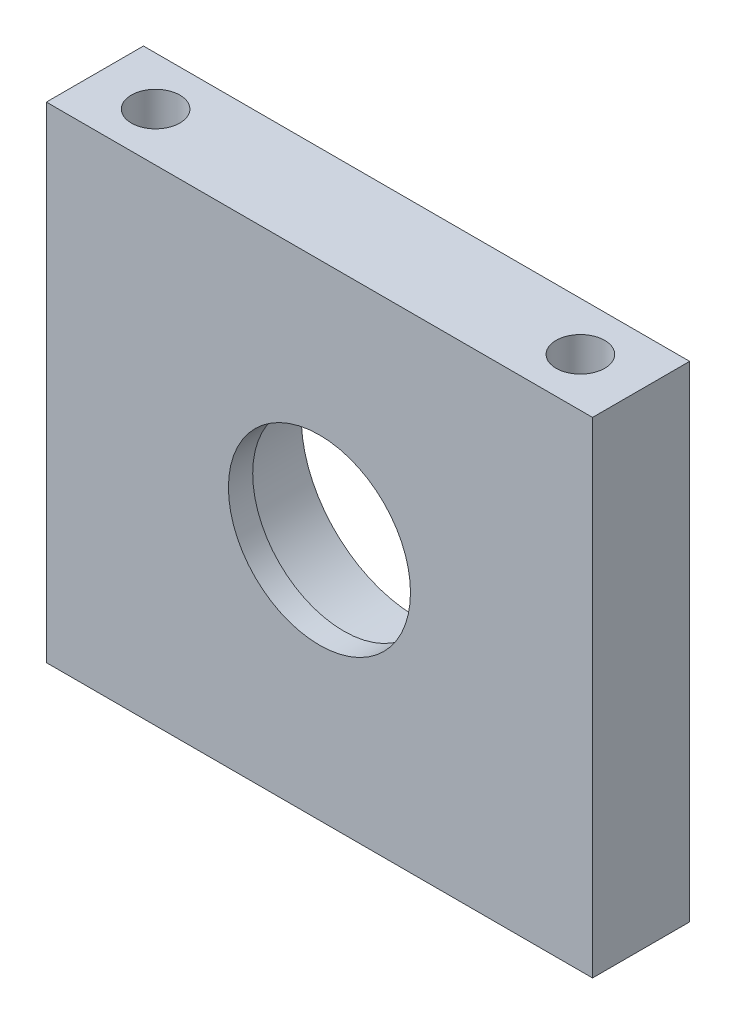
ISO-10303-21;
HEADER;
FILE_DESCRIPTION(('STEP AP214'),'2;1');
FILE_NAME('part.step','',(''),(''),'','','');
FILE_SCHEMA(('AUTOMOTIVE_DESIGN { 1 0 10303 214 1 1 1 1 }'));
ENDSEC;
DATA;
#1=APPLICATION_CONTEXT('core data for automotive mechanical design processes');
#2=APPLICATION_PROTOCOL_DEFINITION('international standard','automotive_design',2000,#1);
#3=PRODUCT_CONTEXT('',#1,'mechanical');
#4=PRODUCT('Part','Part','',(#3));
#5=PRODUCT_RELATED_PRODUCT_CATEGORY('part','',(#4));
#6=PRODUCT_DEFINITION_FORMATION('','',#4);
#7=PRODUCT_DEFINITION_CONTEXT('part definition',#1,'design');
#8=PRODUCT_DEFINITION('design','',#6,#7);
#9=PRODUCT_DEFINITION_SHAPE('','',#8);
#10=(LENGTH_UNIT() NAMED_UNIT(*) SI_UNIT(.MILLI.,.METRE.));
#11=(NAMED_UNIT(*) PLANE_ANGLE_UNIT() SI_UNIT($,.RADIAN.));
#12=(NAMED_UNIT(*) SI_UNIT($,.STERADIAN.) SOLID_ANGLE_UNIT());
#13=UNCERTAINTY_MEASURE_WITH_UNIT(LENGTH_MEASURE(1.E-05),#10,'distance_accuracy_value','');
#14=(GEOMETRIC_REPRESENTATION_CONTEXT(3) GLOBAL_UNCERTAINTY_ASSIGNED_CONTEXT((#13)) GLOBAL_UNIT_ASSIGNED_CONTEXT((#10,
#11,#12)) REPRESENTATION_CONTEXT('',''));
#15=CARTESIAN_POINT('',(0.,0.,0.));
#16=DIRECTION('',(0.,0.,1.));
#17=DIRECTION('',(1.,0.,0.));
#18=AXIS2_PLACEMENT_3D('',#15,#16,#17);
#19=CARTESIAN_POINT('',(0.,0.,0.));
#20=DIRECTION('',(0.,0.,-1.));
#21=DIRECTION('',(1.,0.,0.));
#22=AXIS2_PLACEMENT_3D('',#19,#20,#21);
#23=CYLINDRICAL_SURFACE('',#22,7.5);
#24=CARTESIAN_POINT('',(0.,0.,0.));
#25=DIRECTION('',(0.,0.,1.));
#26=DIRECTION('',(1.,0.,0.));
#27=AXIS2_PLACEMENT_3D('',#24,#25,#26);
#28=CIRCLE('',#27,7.5);
#29=CARTESIAN_POINT('',(7.5,0.,0.));
#30=VERTEX_POINT('',#29);
#31=EDGE_CURVE('E105',#30,#30,#28,.T.);
#32=ORIENTED_EDGE('',*,*,#31,.T.);
#33=EDGE_LOOP('',(#32));
#34=FACE_BOUND('',#33,.T.);
#35=CARTESIAN_POINT('',(0.,0.,-2.));
#36=DIRECTION('',(0.,0.,1.));
#37=DIRECTION('',(1.,0.,0.));
#38=AXIS2_PLACEMENT_3D('',#35,#36,#37);
#39=CIRCLE('',#38,7.5);
#40=CARTESIAN_POINT('',(7.5,0.,-2.));
#41=VERTEX_POINT('',#40);
#42=EDGE_CURVE('E39',#41,#41,#39,.F.);
#43=ORIENTED_EDGE('',*,*,#42,.T.);
#44=EDGE_LOOP('',(#43));
#45=FACE_BOUND('',#44,.T.);
#46=ADVANCED_FACE('F35',(#34,#45),#23,.F.);
#47=CARTESIAN_POINT('',(22.5,-20.,-8.));
#48=DIRECTION('',(-1.,0.,0.));
#49=DIRECTION('',(0.,0.,-1.));
#50=AXIS2_PLACEMENT_3D('',#47,#48,#49);
#51=PLANE('',#50);
#52=DIRECTION('',(0.,1.,0.));
#53=VECTOR('',#52,1.);
#54=CARTESIAN_POINT('',(22.5,-20.,0.));
#55=LINE('',#54,#53);
#56=CARTESIAN_POINT('',(22.5,-20.,0.));
#57=VERTEX_POINT('',#56);
#58=CARTESIAN_POINT('',(22.5,20.,0.));
#59=VERTEX_POINT('',#58);
#60=EDGE_CURVE('E102',#57,#59,#55,.T.);
#61=ORIENTED_EDGE('',*,*,#60,.F.);
#62=DIRECTION('',(0.,0.,1.));
#63=VECTOR('',#62,1.);
#64=CARTESIAN_POINT('',(22.5,-20.,-8.));
#65=LINE('',#64,#63);
#66=CARTESIAN_POINT('',(22.5,-20.,-8.));
#67=VERTEX_POINT('',#66);
#68=EDGE_CURVE('E101',#67,#57,#65,.T.);
#69=ORIENTED_EDGE('',*,*,#68,.F.);
#70=DIRECTION('',(0.,1.,0.));
#71=VECTOR('',#70,1.);
#72=CARTESIAN_POINT('',(22.5,-20.,-8.));
#73=LINE('',#72,#71);
#74=CARTESIAN_POINT('',(22.5,20.,-8.));
#75=VERTEX_POINT('',#74);
#76=EDGE_CURVE('E95',#67,#75,#73,.T.);
#77=ORIENTED_EDGE('',*,*,#76,.T.);
#78=DIRECTION('',(0.,0.,1.));
#79=VECTOR('',#78,1.);
#80=CARTESIAN_POINT('',(22.5,20.,-8.));
#81=LINE('',#80,#79);
#82=EDGE_CURVE('E11',#75,#59,#81,.T.);
#83=ORIENTED_EDGE('',*,*,#82,.T.);
#84=EDGE_LOOP('',(#61,#69,#77,#83));
#85=FACE_BOUND('',#84,.T.);
#86=ADVANCED_FACE('F37',(#85),#51,.F.);
#87=CARTESIAN_POINT('',(-22.5,20.,-8.));
#88=DIRECTION('',(0.,-1.,0.));
#89=DIRECTION('',(0.,0.,1.));
#90=AXIS2_PLACEMENT_3D('',#87,#88,#89);
#91=PLANE('',#90);
#92=CARTESIAN_POINT('',(-17.5,20.,-4.));
#93=DIRECTION('',(0.,-1.,0.));
#94=DIRECTION('',(0.,0.,-1.));
#95=AXIS2_PLACEMENT_3D('',#92,#93,#94);
#96=CIRCLE('',#95,2.);
#97=CARTESIAN_POINT('',(-17.5,20.,-6.));
#98=VERTEX_POINT('',#97);
#99=EDGE_CURVE('E162',#98,#98,#96,.T.);
#100=ORIENTED_EDGE('',*,*,#99,.T.);
#101=EDGE_LOOP('',(#100));
#102=FACE_BOUND('',#101,.T.);
#103=CARTESIAN_POINT('',(17.5,20.,-4.));
#104=DIRECTION('',(0.,-1.,0.));
#105=DIRECTION('',(0.,0.,-1.));
#106=AXIS2_PLACEMENT_3D('',#103,#104,#105);
#107=CIRCLE('',#106,2.);
#108=CARTESIAN_POINT('',(17.5,20.,-6.));
#109=VERTEX_POINT('',#108);
#110=EDGE_CURVE('E156',#109,#109,#107,.T.);
#111=ORIENTED_EDGE('',*,*,#110,.T.);
#112=EDGE_LOOP('',(#111));
#113=FACE_BOUND('',#112,.T.);
#114=DIRECTION('',(-1.,0.,0.));
#115=VECTOR('',#114,1.);
#116=CARTESIAN_POINT('',(-22.5,20.,0.));
#117=LINE('',#116,#115);
#118=CARTESIAN_POINT('',(-22.5,20.,0.));
#119=VERTEX_POINT('',#118);
#120=EDGE_CURVE('E104',#59,#119,#117,.T.);
#121=ORIENTED_EDGE('',*,*,#120,.F.);
#122=ORIENTED_EDGE('',*,*,#82,.F.);
#123=DIRECTION('',(-1.,0.,0.));
#124=VECTOR('',#123,1.);
#125=CARTESIAN_POINT('',(-22.5,20.,-8.));
#126=LINE('',#125,#124);
#127=CARTESIAN_POINT('',(-22.5,20.,-8.));
#128=VERTEX_POINT('',#127);
#129=EDGE_CURVE('E78',#75,#128,#126,.T.);
#130=ORIENTED_EDGE('',*,*,#129,.T.);
#131=DIRECTION('',(0.,0.,1.));
#132=VECTOR('',#131,1.);
#133=CARTESIAN_POINT('',(-22.5,20.,-8.));
#134=LINE('',#133,#132);
#135=EDGE_CURVE('E45',#128,#119,#134,.T.);
#136=ORIENTED_EDGE('',*,*,#135,.T.);
#137=EDGE_LOOP('',(#121,#122,#130,#136));
#138=FACE_BOUND('',#137,.T.);
#139=ADVANCED_FACE('F93',(#102,#113,#138),#91,.F.);
#140=CARTESIAN_POINT('',(-22.5,-20.,-8.));
#141=DIRECTION('',(1.,0.,0.));
#142=DIRECTION('',(0.,0.,1.));
#143=AXIS2_PLACEMENT_3D('',#140,#141,#142);
#144=PLANE('',#143);
#145=DIRECTION('',(0.,-1.,0.));
#146=VECTOR('',#145,1.);
#147=CARTESIAN_POINT('',(-22.5,-20.,0.));
#148=LINE('',#147,#146);
#149=CARTESIAN_POINT('',(-22.5,-20.,0.));
#150=VERTEX_POINT('',#149);
#151=EDGE_CURVE('E88',#119,#150,#148,.T.);
#152=ORIENTED_EDGE('',*,*,#151,.F.);
#153=ORIENTED_EDGE('',*,*,#135,.F.);
#154=DIRECTION('',(0.,-1.,0.));
#155=VECTOR('',#154,1.);
#156=CARTESIAN_POINT('',(-22.5,-20.,-8.));
#157=LINE('',#156,#155);
#158=CARTESIAN_POINT('',(-22.5,-20.,-8.));
#159=VERTEX_POINT('',#158);
#160=EDGE_CURVE('E81',#128,#159,#157,.T.);
#161=ORIENTED_EDGE('',*,*,#160,.T.);
#162=DIRECTION('',(0.,0.,1.));
#163=VECTOR('',#162,1.);
#164=CARTESIAN_POINT('',(-22.5,-20.,-8.));
#165=LINE('',#164,#163);
#166=EDGE_CURVE('E91',#159,#150,#165,.T.);
#167=ORIENTED_EDGE('',*,*,#166,.T.);
#168=EDGE_LOOP('',(#152,#153,#161,#167));
#169=FACE_BOUND('',#168,.T.);
#170=ADVANCED_FACE('F87',(#169),#144,.F.);
#171=CARTESIAN_POINT('',(-22.5,-20.,-8.));
#172=DIRECTION('',(0.,1.,0.));
#173=DIRECTION('',(0.,0.,-1.));
#174=AXIS2_PLACEMENT_3D('',#171,#172,#173);
#175=PLANE('',#174);
#176=CARTESIAN_POINT('',(-17.5,-20.,-4.));
#177=DIRECTION('',(0.,-1.,0.));
#178=DIRECTION('',(0.,0.,-1.));
#179=AXIS2_PLACEMENT_3D('',#176,#177,#178);
#180=CIRCLE('',#179,2.);
#181=CARTESIAN_POINT('',(-17.5,-20.,-6.));
#182=VERTEX_POINT('',#181);
#183=EDGE_CURVE('E153',#182,#182,#180,.T.);
#184=ORIENTED_EDGE('',*,*,#183,.F.);
#185=EDGE_LOOP('',(#184));
#186=FACE_BOUND('',#185,.T.);
#187=CARTESIAN_POINT('',(17.5,-20.,-4.));
#188=DIRECTION('',(0.,-1.,0.));
#189=DIRECTION('',(0.,0.,-1.));
#190=AXIS2_PLACEMENT_3D('',#187,#188,#189);
#191=CIRCLE('',#190,2.);
#192=CARTESIAN_POINT('',(17.5,-20.,-6.));
#193=VERTEX_POINT('',#192);
#194=EDGE_CURVE('E159',#193,#193,#191,.T.);
#195=ORIENTED_EDGE('',*,*,#194,.F.);
#196=EDGE_LOOP('',(#195));
#197=FACE_BOUND('',#196,.T.);
#198=DIRECTION('',(1.,0.,0.));
#199=VECTOR('',#198,1.);
#200=CARTESIAN_POINT('',(-22.5,-20.,0.));
#201=LINE('',#200,#199);
#202=EDGE_CURVE('E67',#150,#57,#201,.T.);
#203=ORIENTED_EDGE('',*,*,#202,.F.);
#204=ORIENTED_EDGE('',*,*,#166,.F.);
#205=DIRECTION('',(1.,0.,0.));
#206=VECTOR('',#205,1.);
#207=CARTESIAN_POINT('',(-22.5,-20.,-8.));
#208=LINE('',#207,#206);
#209=EDGE_CURVE('E53',#159,#67,#208,.T.);
#210=ORIENTED_EDGE('',*,*,#209,.T.);
#211=ORIENTED_EDGE('',*,*,#68,.T.);
#212=EDGE_LOOP('',(#203,#204,#210,#211));
#213=FACE_BOUND('',#212,.T.);
#214=ADVANCED_FACE('F114',(#186,#197,#213),#175,.F.);
#215=CARTESIAN_POINT('',(0.,0.,-8.));
#216=DIRECTION('',(0.,0.,1.));
#217=DIRECTION('',(-1.,0.,0.));
#218=AXIS2_PLACEMENT_3D('',#215,#216,#217);
#219=PLANE('',#218);
#220=CARTESIAN_POINT('',(0.,0.,-8.));
#221=DIRECTION('',(0.,0.,1.));
#222=DIRECTION('',(1.,0.,0.));
#223=AXIS2_PLACEMENT_3D('',#220,#221,#222);
#224=CIRCLE('',#223,9.5);
#225=CARTESIAN_POINT('',(9.5,0.,-8.));
#226=VERTEX_POINT('',#225);
#227=EDGE_CURVE('E150',#226,#226,#224,.T.);
#228=ORIENTED_EDGE('',*,*,#227,.T.);
#229=EDGE_LOOP('',(#228));
#230=FACE_BOUND('',#229,.T.);
#231=ORIENTED_EDGE('',*,*,#76,.F.);
#232=ORIENTED_EDGE('',*,*,#209,.F.);
#233=ORIENTED_EDGE('',*,*,#160,.F.);
#234=ORIENTED_EDGE('',*,*,#129,.F.);
#235=EDGE_LOOP('',(#231,#232,#233,#234));
#236=FACE_BOUND('',#235,.T.);
#237=ADVANCED_FACE('F83',(#230,#236),#219,.F.);
#238=CARTESIAN_POINT('',(0.,0.,0.));
#239=DIRECTION('',(0.,0.,1.));
#240=DIRECTION('',(-1.,0.,0.));
#241=AXIS2_PLACEMENT_3D('',#238,#239,#240);
#242=PLANE('',#241);
#243=ORIENTED_EDGE('',*,*,#31,.F.);
#244=EDGE_LOOP('',(#243));
#245=FACE_BOUND('',#244,.T.);
#246=ORIENTED_EDGE('',*,*,#60,.T.);
#247=ORIENTED_EDGE('',*,*,#120,.T.);
#248=ORIENTED_EDGE('',*,*,#151,.T.);
#249=ORIENTED_EDGE('',*,*,#202,.T.);
#250=EDGE_LOOP('',(#246,#247,#248,#249));
#251=FACE_BOUND('',#250,.T.);
#252=ADVANCED_FACE('F110',(#245,#251),#242,.T.);
#253=CARTESIAN_POINT('',(0.,0.,-2.));
#254=DIRECTION('',(0.,0.,-1.));
#255=DIRECTION('',(1.,0.,0.));
#256=AXIS2_PLACEMENT_3D('',#253,#254,#255);
#257=PLANE('',#256);
#258=CARTESIAN_POINT('',(0.,0.,-2.));
#259=DIRECTION('',(0.,0.,1.));
#260=DIRECTION('',(1.,0.,0.));
#261=AXIS2_PLACEMENT_3D('',#258,#259,#260);
#262=CIRCLE('',#261,9.5);
#263=CARTESIAN_POINT('',(9.5,0.,-2.));
#264=VERTEX_POINT('',#263);
#265=EDGE_CURVE('E148',#264,#264,#262,.T.);
#266=ORIENTED_EDGE('',*,*,#265,.F.);
#267=EDGE_LOOP('',(#266));
#268=FACE_BOUND('',#267,.T.);
#269=ORIENTED_EDGE('',*,*,#42,.F.);
#270=EDGE_LOOP('',(#269));
#271=FACE_BOUND('',#270,.T.);
#272=ADVANCED_FACE('F140',(#268,#271),#257,.T.);
#273=CARTESIAN_POINT('',(0.,0.,-2.));
#274=DIRECTION('',(0.,0.,-1.));
#275=DIRECTION('',(1.,0.,0.));
#276=AXIS2_PLACEMENT_3D('',#273,#274,#275);
#277=CYLINDRICAL_SURFACE('',#276,9.5);
#278=ORIENTED_EDGE('',*,*,#265,.T.);
#279=EDGE_LOOP('',(#278));
#280=FACE_BOUND('',#279,.T.);
#281=ORIENTED_EDGE('',*,*,#227,.F.);
#282=EDGE_LOOP('',(#281));
#283=FACE_BOUND('',#282,.T.);
#284=ADVANCED_FACE('F137',(#280,#283),#277,.F.);
#285=CARTESIAN_POINT('',(17.5,-20.,-4.));
#286=DIRECTION('',(0.,1.,0.));
#287=DIRECTION('',(0.,0.,-1.));
#288=AXIS2_PLACEMENT_3D('',#285,#286,#287);
#289=CYLINDRICAL_SURFACE('',#288,2.);
#290=ORIENTED_EDGE('',*,*,#194,.T.);
#291=EDGE_LOOP('',(#290));
#292=FACE_BOUND('',#291,.T.);
#293=ORIENTED_EDGE('',*,*,#110,.F.);
#294=EDGE_LOOP('',(#293));
#295=FACE_BOUND('',#294,.T.);
#296=ADVANCED_FACE('F170',(#292,#295),#289,.F.);
#297=CARTESIAN_POINT('',(-17.5,-20.,-4.));
#298=DIRECTION('',(0.,1.,0.));
#299=DIRECTION('',(0.,0.,-1.));
#300=AXIS2_PLACEMENT_3D('',#297,#298,#299);
#301=CYLINDRICAL_SURFACE('',#300,2.);
#302=ORIENTED_EDGE('',*,*,#183,.T.);
#303=EDGE_LOOP('',(#302));
#304=FACE_BOUND('',#303,.T.);
#305=ORIENTED_EDGE('',*,*,#99,.F.);
#306=EDGE_LOOP('',(#305));
#307=FACE_BOUND('',#306,.T.);
#308=ADVANCED_FACE('F167',(#304,#307),#301,.F.);
#309=CLOSED_SHELL('',(#46,#86,#139,#170,#214,#237,#252,#272,#284,#296,#308));
#310=MANIFOLD_SOLID_BREP('B2',#309);
#311=ADVANCED_BREP_SHAPE_REPRESENTATION('',(#18,#310),#14);
#312=SHAPE_DEFINITION_REPRESENTATION(#9,#311);
ENDSEC;
END-ISO-10303-21;
